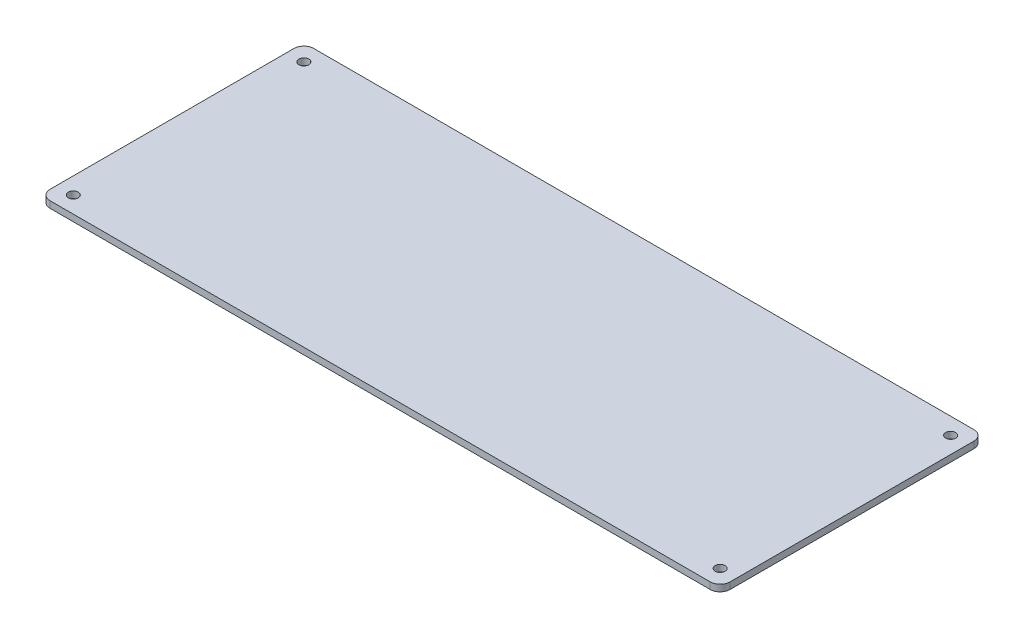
ISO-10303-21;
HEADER;
FILE_DESCRIPTION(('STEP AP214'),'2;1');
FILE_NAME('part.step','',(''),(''),'','','');
FILE_SCHEMA(('AUTOMOTIVE_DESIGN { 1 0 10303 214 1 1 1 1 }'));
ENDSEC;
DATA;
#1=APPLICATION_CONTEXT('core data for automotive mechanical design processes');
#2=APPLICATION_PROTOCOL_DEFINITION('international standard','automotive_design',2000,#1);
#3=PRODUCT_CONTEXT('',#1,'mechanical');
#4=PRODUCT('Part','Part','',(#3));
#5=PRODUCT_RELATED_PRODUCT_CATEGORY('part','',(#4));
#6=PRODUCT_DEFINITION_FORMATION('','',#4);
#7=PRODUCT_DEFINITION_CONTEXT('part definition',#1,'design');
#8=PRODUCT_DEFINITION('design','',#6,#7);
#9=PRODUCT_DEFINITION_SHAPE('','',#8);
#10=(LENGTH_UNIT() NAMED_UNIT(*) SI_UNIT(.MILLI.,.METRE.));
#11=(NAMED_UNIT(*) PLANE_ANGLE_UNIT() SI_UNIT($,.RADIAN.));
#12=(NAMED_UNIT(*) SI_UNIT($,.STERADIAN.) SOLID_ANGLE_UNIT());
#13=UNCERTAINTY_MEASURE_WITH_UNIT(LENGTH_MEASURE(1.E-05),#10,'distance_accuracy_value','');
#14=(GEOMETRIC_REPRESENTATION_CONTEXT(3) GLOBAL_UNCERTAINTY_ASSIGNED_CONTEXT((#13)) GLOBAL_UNIT_ASSIGNED_CONTEXT((#10,
#11,#12)) REPRESENTATION_CONTEXT('',''));
#15=CARTESIAN_POINT('',(0.,0.,0.));
#16=DIRECTION('',(0.,0.,1.));
#17=DIRECTION('',(1.,0.,0.));
#18=AXIS2_PLACEMENT_3D('',#15,#16,#17);
#19=CARTESIAN_POINT('',(102.5,2.,39.75));
#20=DIRECTION('',(-1.,0.,0.));
#21=DIRECTION('',(0.,0.,1.));
#22=AXIS2_PLACEMENT_3D('',#19,#20,#21);
#23=PLANE('',#22);
#24=DIRECTION('',(0.,0.,-1.));
#25=VECTOR('',#24,1.);
#26=CARTESIAN_POINT('',(102.5,0.,39.75));
#27=LINE('',#26,#25);
#28=CARTESIAN_POINT('',(102.5,0.,36.75));
#29=VERTEX_POINT('',#28);
#30=CARTESIAN_POINT('',(102.5,0.,-36.75));
#31=VERTEX_POINT('',#30);
#32=EDGE_CURVE('E188',#29,#31,#27,.T.);
#33=ORIENTED_EDGE('',*,*,#32,.T.);
#34=DIRECTION('',(0.,-1.,0.));
#35=VECTOR('',#34,1.);
#36=CARTESIAN_POINT('',(102.5,2.,-36.75));
#37=LINE('',#36,#35);
#38=CARTESIAN_POINT('',(102.5,2.,-36.75));
#39=VERTEX_POINT('',#38);
#40=EDGE_CURVE('E165',#31,#39,#37,.F.);
#41=ORIENTED_EDGE('',*,*,#40,.T.);
#42=DIRECTION('',(0.,0.,-1.));
#43=VECTOR('',#42,1.);
#44=CARTESIAN_POINT('',(102.5,2.,39.75));
#45=LINE('',#44,#43);
#46=CARTESIAN_POINT('',(102.5,2.,36.75));
#47=VERTEX_POINT('',#46);
#48=EDGE_CURVE('E129',#47,#39,#45,.T.);
#49=ORIENTED_EDGE('',*,*,#48,.F.);
#50=DIRECTION('',(0.,-1.,0.));
#51=VECTOR('',#50,1.);
#52=CARTESIAN_POINT('',(102.5,2.,36.75));
#53=LINE('',#52,#51);
#54=EDGE_CURVE('E146',#47,#29,#53,.T.);
#55=ORIENTED_EDGE('',*,*,#54,.T.);
#56=EDGE_LOOP('',(#33,#41,#49,#55));
#57=FACE_BOUND('',#56,.T.);
#58=ADVANCED_FACE('F38',(#57),#23,.F.);
#59=CARTESIAN_POINT('',(-102.5,2.,-39.75));
#60=DIRECTION('',(0.,0.,1.));
#61=DIRECTION('',(1.,0.,0.));
#62=AXIS2_PLACEMENT_3D('',#59,#60,#61);
#63=PLANE('',#62);
#64=DIRECTION('',(-1.,0.,0.));
#65=VECTOR('',#64,1.);
#66=CARTESIAN_POINT('',(-102.5,0.,-39.75));
#67=LINE('',#66,#65);
#68=CARTESIAN_POINT('',(99.4999999999999,0.,-39.75));
#69=VERTEX_POINT('',#68);
#70=CARTESIAN_POINT('',(-99.5,0.,-39.75));
#71=VERTEX_POINT('',#70);
#72=EDGE_CURVE('E137',#69,#71,#67,.T.);
#73=ORIENTED_EDGE('',*,*,#72,.T.);
#74=DIRECTION('',(0.,-1.,0.));
#75=VECTOR('',#74,1.);
#76=CARTESIAN_POINT('',(-99.5,2.,-39.75));
#77=LINE('',#76,#75);
#78=CARTESIAN_POINT('',(-99.5,2.,-39.75));
#79=VERTEX_POINT('',#78);
#80=EDGE_CURVE('E47',#71,#79,#77,.F.);
#81=ORIENTED_EDGE('',*,*,#80,.T.);
#82=DIRECTION('',(-1.,0.,0.));
#83=VECTOR('',#82,1.);
#84=CARTESIAN_POINT('',(-102.5,2.,-39.75));
#85=LINE('',#84,#83);
#86=CARTESIAN_POINT('',(99.4999999999999,2.,-39.75));
#87=VERTEX_POINT('',#86);
#88=EDGE_CURVE('E135',#87,#79,#85,.T.);
#89=ORIENTED_EDGE('',*,*,#88,.F.);
#90=DIRECTION('',(0.,-1.,0.));
#91=VECTOR('',#90,1.);
#92=CARTESIAN_POINT('',(99.5,2.,-39.75));
#93=LINE('',#92,#91);
#94=EDGE_CURVE('E158',#87,#69,#93,.T.);
#95=ORIENTED_EDGE('',*,*,#94,.T.);
#96=EDGE_LOOP('',(#73,#81,#89,#95));
#97=FACE_BOUND('',#96,.T.);
#98=ADVANCED_FACE('F193',(#97),#63,.F.);
#99=CARTESIAN_POINT('',(-102.5,2.,39.75));
#100=DIRECTION('',(1.,0.,0.));
#101=DIRECTION('',(0.,0.,-1.));
#102=AXIS2_PLACEMENT_3D('',#99,#100,#101);
#103=PLANE('',#102);
#104=DIRECTION('',(0.,0.,1.));
#105=VECTOR('',#104,1.);
#106=CARTESIAN_POINT('',(-102.5,2.,39.75));
#107=LINE('',#106,#105);
#108=CARTESIAN_POINT('',(-102.5,2.,-36.75));
#109=VERTEX_POINT('',#108);
#110=CARTESIAN_POINT('',(-102.5,2.,36.75));
#111=VERTEX_POINT('',#110);
#112=EDGE_CURVE('E179',#109,#111,#107,.T.);
#113=ORIENTED_EDGE('',*,*,#112,.F.);
#114=DIRECTION('',(0.,-1.,0.));
#115=VECTOR('',#114,1.);
#116=CARTESIAN_POINT('',(-102.5,2.,-36.75));
#117=LINE('',#116,#115);
#118=CARTESIAN_POINT('',(-102.5,0.,-36.75));
#119=VERTEX_POINT('',#118);
#120=EDGE_CURVE('E171',#109,#119,#117,.T.);
#121=ORIENTED_EDGE('',*,*,#120,.T.);
#122=DIRECTION('',(0.,0.,1.));
#123=VECTOR('',#122,1.);
#124=CARTESIAN_POINT('',(-102.5,0.,39.75));
#125=LINE('',#124,#123);
#126=CARTESIAN_POINT('',(-102.5,0.,36.75));
#127=VERTEX_POINT('',#126);
#128=EDGE_CURVE('E130',#119,#127,#125,.T.);
#129=ORIENTED_EDGE('',*,*,#128,.T.);
#130=DIRECTION('',(0.,-1.,0.));
#131=VECTOR('',#130,1.);
#132=CARTESIAN_POINT('',(-102.5,2.,36.75));
#133=LINE('',#132,#131);
#134=EDGE_CURVE('E111',#127,#111,#133,.F.);
#135=ORIENTED_EDGE('',*,*,#134,.T.);
#136=EDGE_LOOP('',(#113,#121,#129,#135));
#137=FACE_BOUND('',#136,.T.);
#138=ADVANCED_FACE('F200',(#137),#103,.F.);
#139=CARTESIAN_POINT('',(-102.5,2.,39.75));
#140=DIRECTION('',(0.,0.,-1.));
#141=DIRECTION('',(-1.,0.,0.));
#142=AXIS2_PLACEMENT_3D('',#139,#140,#141);
#143=PLANE('',#142);
#144=DIRECTION('',(1.,0.,0.));
#145=VECTOR('',#144,1.);
#146=CARTESIAN_POINT('',(-102.5,0.,39.75));
#147=LINE('',#146,#145);
#148=CARTESIAN_POINT('',(-99.5,0.,39.75));
#149=VERTEX_POINT('',#148);
#150=CARTESIAN_POINT('',(99.4999999999999,0.,39.75));
#151=VERTEX_POINT('',#150);
#152=EDGE_CURVE('E119',#149,#151,#147,.T.);
#153=ORIENTED_EDGE('',*,*,#152,.T.);
#154=DIRECTION('',(0.,-1.,0.));
#155=VECTOR('',#154,1.);
#156=CARTESIAN_POINT('',(99.5,2.,39.75));
#157=LINE('',#156,#155);
#158=CARTESIAN_POINT('',(99.4999999999999,2.,39.75));
#159=VERTEX_POINT('',#158);
#160=EDGE_CURVE('E152',#151,#159,#157,.F.);
#161=ORIENTED_EDGE('',*,*,#160,.T.);
#162=DIRECTION('',(1.,0.,0.));
#163=VECTOR('',#162,1.);
#164=CARTESIAN_POINT('',(-102.5,2.,39.75));
#165=LINE('',#164,#163);
#166=CARTESIAN_POINT('',(-99.5,2.,39.75));
#167=VERTEX_POINT('',#166);
#168=EDGE_CURVE('E122',#167,#159,#165,.T.);
#169=ORIENTED_EDGE('',*,*,#168,.F.);
#170=DIRECTION('',(0.,-1.,0.));
#171=VECTOR('',#170,1.);
#172=CARTESIAN_POINT('',(-99.5,2.,39.75));
#173=LINE('',#172,#171);
#174=EDGE_CURVE('E109',#167,#149,#173,.T.);
#175=ORIENTED_EDGE('',*,*,#174,.T.);
#176=EDGE_LOOP('',(#153,#161,#169,#175));
#177=FACE_BOUND('',#176,.T.);
#178=ADVANCED_FACE('F118',(#177),#143,.F.);
#179=CARTESIAN_POINT('',(0.,2.,0.));
#180=DIRECTION('',(0.,-1.,0.));
#181=DIRECTION('',(0.,0.,-1.));
#182=AXIS2_PLACEMENT_3D('',#179,#180,#181);
#183=PLANE('',#182);
#184=CARTESIAN_POINT('',(97.5,2.,-34.75));
#185=DIRECTION('',(0.,1.,0.));
#186=DIRECTION('',(0.,0.,1.));
#187=AXIS2_PLACEMENT_3D('',#184,#185,#186);
#188=CIRCLE('',#187,1.5);
#189=CARTESIAN_POINT('',(97.5,2.,-33.25));
#190=VERTEX_POINT('',#189);
#191=EDGE_CURVE('E358',#190,#190,#188,.T.);
#192=ORIENTED_EDGE('',*,*,#191,.F.);
#193=EDGE_LOOP('',(#192));
#194=FACE_BOUND('',#193,.T.);
#195=CARTESIAN_POINT('',(97.5,2.,34.75));
#196=DIRECTION('',(0.,1.,0.));
#197=DIRECTION('',(0.,0.,1.));
#198=AXIS2_PLACEMENT_3D('',#195,#196,#197);
#199=CIRCLE('',#198,1.5);
#200=CARTESIAN_POINT('',(97.5,2.,36.25));
#201=VERTEX_POINT('',#200);
#202=EDGE_CURVE('E348',#201,#201,#199,.T.);
#203=ORIENTED_EDGE('',*,*,#202,.F.);
#204=EDGE_LOOP('',(#203));
#205=FACE_BOUND('',#204,.T.);
#206=CARTESIAN_POINT('',(-97.5,2.,34.75));
#207=DIRECTION('',(0.,1.,0.));
#208=DIRECTION('',(0.,0.,1.));
#209=AXIS2_PLACEMENT_3D('',#206,#207,#208);
#210=CIRCLE('',#209,1.5);
#211=CARTESIAN_POINT('',(-97.5,2.,36.25));
#212=VERTEX_POINT('',#211);
#213=EDGE_CURVE('E338',#212,#212,#210,.T.);
#214=ORIENTED_EDGE('',*,*,#213,.F.);
#215=EDGE_LOOP('',(#214));
#216=FACE_BOUND('',#215,.T.);
#217=CARTESIAN_POINT('',(-97.5,2.,-34.75));
#218=DIRECTION('',(0.,1.,0.));
#219=DIRECTION('',(0.,0.,1.));
#220=AXIS2_PLACEMENT_3D('',#217,#218,#219);
#221=CIRCLE('',#220,1.5);
#222=CARTESIAN_POINT('',(-97.5,2.,-33.25));
#223=VERTEX_POINT('',#222);
#224=EDGE_CURVE('E345',#223,#223,#221,.T.);
#225=ORIENTED_EDGE('',*,*,#224,.F.);
#226=EDGE_LOOP('',(#225));
#227=FACE_BOUND('',#226,.T.);
#228=ORIENTED_EDGE('',*,*,#88,.T.);
#229=CARTESIAN_POINT('',(-99.5,2.,-36.75));
#230=DIRECTION('',(0.,-1.,0.));
#231=DIRECTION('',(0.,0.,-1.));
#232=AXIS2_PLACEMENT_3D('',#229,#230,#231);
#233=CIRCLE('',#232,3.);
#234=EDGE_CURVE('E11',#79,#109,#233,.F.);
#235=ORIENTED_EDGE('',*,*,#234,.T.);
#236=ORIENTED_EDGE('',*,*,#112,.T.);
#237=CARTESIAN_POINT('',(-99.5,2.,36.75));
#238=DIRECTION('',(0.,-1.,0.));
#239=DIRECTION('',(0.,0.,-1.));
#240=AXIS2_PLACEMENT_3D('',#237,#238,#239);
#241=CIRCLE('',#240,3.);
#242=EDGE_CURVE('E143',#111,#167,#241,.F.);
#243=ORIENTED_EDGE('',*,*,#242,.T.);
#244=ORIENTED_EDGE('',*,*,#168,.T.);
#245=CARTESIAN_POINT('',(99.5,2.,36.75));
#246=DIRECTION('',(0.,-1.,0.));
#247=DIRECTION('',(0.,0.,-1.));
#248=AXIS2_PLACEMENT_3D('',#245,#246,#247);
#249=CIRCLE('',#248,3.);
#250=EDGE_CURVE('E155',#159,#47,#249,.F.);
#251=ORIENTED_EDGE('',*,*,#250,.T.);
#252=ORIENTED_EDGE('',*,*,#48,.T.);
#253=CARTESIAN_POINT('',(99.5,2.,-36.75));
#254=DIRECTION('',(0.,-1.,0.));
#255=DIRECTION('',(0.,0.,-1.));
#256=AXIS2_PLACEMENT_3D('',#253,#254,#255);
#257=CIRCLE('',#256,3.);
#258=EDGE_CURVE('E168',#39,#87,#257,.F.);
#259=ORIENTED_EDGE('',*,*,#258,.T.);
#260=EDGE_LOOP('',(#228,#235,#236,#243,#244,#251,#252,#259));
#261=FACE_BOUND('',#260,.T.);
#262=ADVANCED_FACE('F198',(#194,#205,#216,#227,#261),#183,.F.);
#263=CARTESIAN_POINT('',(0.,0.,0.));
#264=DIRECTION('',(0.,-1.,0.));
#265=DIRECTION('',(0.,0.,-1.));
#266=AXIS2_PLACEMENT_3D('',#263,#264,#265);
#267=PLANE('',#266);
#268=CARTESIAN_POINT('',(97.5,0.,-34.75));
#269=DIRECTION('',(0.,1.,0.));
#270=DIRECTION('',(0.,0.,1.));
#271=AXIS2_PLACEMENT_3D('',#268,#269,#270);
#272=CIRCLE('',#271,1.5);
#273=CARTESIAN_POINT('',(97.5,0.,-33.25));
#274=VERTEX_POINT('',#273);
#275=EDGE_CURVE('E354',#274,#274,#272,.T.);
#276=ORIENTED_EDGE('',*,*,#275,.T.);
#277=EDGE_LOOP('',(#276));
#278=FACE_BOUND('',#277,.T.);
#279=CARTESIAN_POINT('',(97.5,0.,34.75));
#280=DIRECTION('',(0.,1.,0.));
#281=DIRECTION('',(0.,0.,1.));
#282=AXIS2_PLACEMENT_3D('',#279,#280,#281);
#283=CIRCLE('',#282,1.5);
#284=CARTESIAN_POINT('',(97.5,0.,36.25));
#285=VERTEX_POINT('',#284);
#286=EDGE_CURVE('E341',#285,#285,#283,.T.);
#287=ORIENTED_EDGE('',*,*,#286,.T.);
#288=EDGE_LOOP('',(#287));
#289=FACE_BOUND('',#288,.T.);
#290=CARTESIAN_POINT('',(-97.5,0.,34.75));
#291=DIRECTION('',(0.,1.,0.));
#292=DIRECTION('',(0.,0.,1.));
#293=AXIS2_PLACEMENT_3D('',#290,#291,#292);
#294=CIRCLE('',#293,1.5);
#295=CARTESIAN_POINT('',(-97.5,0.,36.25));
#296=VERTEX_POINT('',#295);
#297=EDGE_CURVE('E335',#296,#296,#294,.T.);
#298=ORIENTED_EDGE('',*,*,#297,.T.);
#299=EDGE_LOOP('',(#298));
#300=FACE_BOUND('',#299,.T.);
#301=CARTESIAN_POINT('',(-97.5,0.,-34.75));
#302=DIRECTION('',(0.,1.,0.));
#303=DIRECTION('',(0.,0.,1.));
#304=AXIS2_PLACEMENT_3D('',#301,#302,#303);
#305=CIRCLE('',#304,1.5);
#306=CARTESIAN_POINT('',(-97.5,0.,-33.25));
#307=VERTEX_POINT('',#306);
#308=EDGE_CURVE('E191',#307,#307,#305,.T.);
#309=ORIENTED_EDGE('',*,*,#308,.T.);
#310=EDGE_LOOP('',(#309));
#311=FACE_BOUND('',#310,.T.);
#312=ORIENTED_EDGE('',*,*,#128,.F.);
#313=CARTESIAN_POINT('',(-99.5,0.,-36.75));
#314=DIRECTION('',(0.,-1.,0.));
#315=DIRECTION('',(0.,0.,-1.));
#316=AXIS2_PLACEMENT_3D('',#313,#314,#315);
#317=CIRCLE('',#316,3.);
#318=EDGE_CURVE('E61',#119,#71,#317,.T.);
#319=ORIENTED_EDGE('',*,*,#318,.T.);
#320=ORIENTED_EDGE('',*,*,#72,.F.);
#321=CARTESIAN_POINT('',(99.5,0.,-36.75));
#322=DIRECTION('',(0.,-1.,0.));
#323=DIRECTION('',(0.,0.,-1.));
#324=AXIS2_PLACEMENT_3D('',#321,#322,#323);
#325=CIRCLE('',#324,3.);
#326=EDGE_CURVE('E162',#69,#31,#325,.T.);
#327=ORIENTED_EDGE('',*,*,#326,.T.);
#328=ORIENTED_EDGE('',*,*,#32,.F.);
#329=CARTESIAN_POINT('',(99.5,0.,36.75));
#330=DIRECTION('',(0.,-1.,0.));
#331=DIRECTION('',(0.,0.,-1.));
#332=AXIS2_PLACEMENT_3D('',#329,#330,#331);
#333=CIRCLE('',#332,3.);
#334=EDGE_CURVE('E127',#29,#151,#333,.T.);
#335=ORIENTED_EDGE('',*,*,#334,.T.);
#336=ORIENTED_EDGE('',*,*,#152,.F.);
#337=CARTESIAN_POINT('',(-99.5,0.,36.75));
#338=DIRECTION('',(0.,-1.,0.));
#339=DIRECTION('',(0.,0.,-1.));
#340=AXIS2_PLACEMENT_3D('',#337,#338,#339);
#341=CIRCLE('',#340,3.);
#342=EDGE_CURVE('E105',#149,#127,#341,.T.);
#343=ORIENTED_EDGE('',*,*,#342,.T.);
#344=EDGE_LOOP('',(#312,#319,#320,#327,#328,#335,#336,#343));
#345=FACE_BOUND('',#344,.T.);
#346=ADVANCED_FACE('F125',(#278,#289,#300,#311,#345),#267,.T.);
#347=CARTESIAN_POINT('',(-97.5,0.,-34.75));
#348=DIRECTION('',(0.,1.,0.));
#349=DIRECTION('',(0.,0.,1.));
#350=AXIS2_PLACEMENT_3D('',#347,#348,#349);
#351=CYLINDRICAL_SURFACE('',#350,1.5);
#352=ORIENTED_EDGE('',*,*,#308,.F.);
#353=EDGE_LOOP('',(#352));
#354=FACE_BOUND('',#353,.T.);
#355=ORIENTED_EDGE('',*,*,#224,.T.);
#356=EDGE_LOOP('',(#355));
#357=FACE_BOUND('',#356,.T.);
#358=ADVANCED_FACE('F244',(#354,#357),#351,.F.);
#359=CARTESIAN_POINT('',(-97.5,0.,34.75));
#360=DIRECTION('',(0.,1.,0.));
#361=DIRECTION('',(0.,0.,1.));
#362=AXIS2_PLACEMENT_3D('',#359,#360,#361);
#363=CYLINDRICAL_SURFACE('',#362,1.5);
#364=ORIENTED_EDGE('',*,*,#297,.F.);
#365=EDGE_LOOP('',(#364));
#366=FACE_BOUND('',#365,.T.);
#367=ORIENTED_EDGE('',*,*,#213,.T.);
#368=EDGE_LOOP('',(#367));
#369=FACE_BOUND('',#368,.T.);
#370=ADVANCED_FACE('F237',(#366,#369),#363,.F.);
#371=CARTESIAN_POINT('',(97.5,0.,34.75));
#372=DIRECTION('',(0.,1.,0.));
#373=DIRECTION('',(0.,0.,1.));
#374=AXIS2_PLACEMENT_3D('',#371,#372,#373);
#375=CYLINDRICAL_SURFACE('',#374,1.5);
#376=ORIENTED_EDGE('',*,*,#286,.F.);
#377=EDGE_LOOP('',(#376));
#378=FACE_BOUND('',#377,.T.);
#379=ORIENTED_EDGE('',*,*,#202,.T.);
#380=EDGE_LOOP('',(#379));
#381=FACE_BOUND('',#380,.T.);
#382=ADVANCED_FACE('F231',(#378,#381),#375,.F.);
#383=CARTESIAN_POINT('',(97.5,0.,-34.75));
#384=DIRECTION('',(0.,1.,0.));
#385=DIRECTION('',(0.,0.,1.));
#386=AXIS2_PLACEMENT_3D('',#383,#384,#385);
#387=CYLINDRICAL_SURFACE('',#386,1.5);
#388=ORIENTED_EDGE('',*,*,#275,.F.);
#389=EDGE_LOOP('',(#388));
#390=FACE_BOUND('',#389,.T.);
#391=ORIENTED_EDGE('',*,*,#191,.T.);
#392=EDGE_LOOP('',(#391));
#393=FACE_BOUND('',#392,.T.);
#394=ADVANCED_FACE('F227',(#390,#393),#387,.F.);
#395=CARTESIAN_POINT('',(-99.5,2.,36.75));
#396=DIRECTION('',(0.,-1.,0.));
#397=DIRECTION('',(0.,0.,-1.));
#398=AXIS2_PLACEMENT_3D('',#395,#396,#397);
#399=CYLINDRICAL_SURFACE('',#398,3.);
#400=ORIENTED_EDGE('',*,*,#242,.F.);
#401=ORIENTED_EDGE('',*,*,#134,.F.);
#402=ORIENTED_EDGE('',*,*,#342,.F.);
#403=ORIENTED_EDGE('',*,*,#174,.F.);
#404=EDGE_LOOP('',(#400,#401,#402,#403));
#405=FACE_BOUND('',#404,.T.);
#406=ADVANCED_FACE('F108',(#405),#399,.T.);
#407=CARTESIAN_POINT('',(99.5,2.,36.75));
#408=DIRECTION('',(0.,-1.,0.));
#409=DIRECTION('',(0.,0.,-1.));
#410=AXIS2_PLACEMENT_3D('',#407,#408,#409);
#411=CYLINDRICAL_SURFACE('',#410,3.);
#412=ORIENTED_EDGE('',*,*,#250,.F.);
#413=ORIENTED_EDGE('',*,*,#160,.F.);
#414=ORIENTED_EDGE('',*,*,#334,.F.);
#415=ORIENTED_EDGE('',*,*,#54,.F.);
#416=EDGE_LOOP('',(#412,#413,#414,#415));
#417=FACE_BOUND('',#416,.T.);
#418=ADVANCED_FACE('F205',(#417),#411,.T.);
#419=CARTESIAN_POINT('',(99.5,2.,-36.75));
#420=DIRECTION('',(0.,-1.,0.));
#421=DIRECTION('',(0.,0.,-1.));
#422=AXIS2_PLACEMENT_3D('',#419,#420,#421);
#423=CYLINDRICAL_SURFACE('',#422,3.);
#424=ORIENTED_EDGE('',*,*,#258,.F.);
#425=ORIENTED_EDGE('',*,*,#40,.F.);
#426=ORIENTED_EDGE('',*,*,#326,.F.);
#427=ORIENTED_EDGE('',*,*,#94,.F.);
#428=EDGE_LOOP('',(#424,#425,#426,#427));
#429=FACE_BOUND('',#428,.T.);
#430=ADVANCED_FACE('F210',(#429),#423,.T.);
#431=CARTESIAN_POINT('',(-99.5,2.,-36.75));
#432=DIRECTION('',(0.,-1.,0.));
#433=DIRECTION('',(0.,0.,-1.));
#434=AXIS2_PLACEMENT_3D('',#431,#432,#433);
#435=CYLINDRICAL_SURFACE('',#434,3.);
#436=ORIENTED_EDGE('',*,*,#234,.F.);
#437=ORIENTED_EDGE('',*,*,#80,.F.);
#438=ORIENTED_EDGE('',*,*,#318,.F.);
#439=ORIENTED_EDGE('',*,*,#120,.F.);
#440=EDGE_LOOP('',(#436,#437,#438,#439));
#441=FACE_BOUND('',#440,.T.);
#442=ADVANCED_FACE('F40',(#441),#435,.T.);
#443=CLOSED_SHELL('',(#58,#98,#138,#178,#262,#346,#358,#370,#382,#394,#406,#418,#430,#442));
#444=MANIFOLD_SOLID_BREP('B2',#443);
#445=ADVANCED_BREP_SHAPE_REPRESENTATION('',(#18,#444),#14);
#446=SHAPE_DEFINITION_REPRESENTATION(#9,#445);
ENDSEC;
END-ISO-10303-21;
